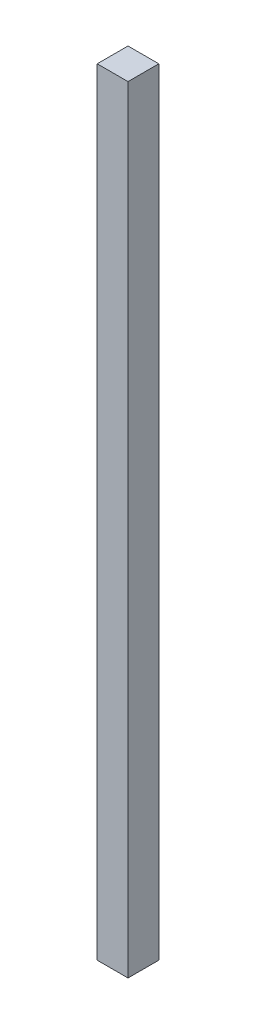
ISO-10303-21;
HEADER;
FILE_DESCRIPTION(('STEP AP214'),'2;1');
FILE_NAME('part.step','',(''),(''),'','','');
FILE_SCHEMA(('AUTOMOTIVE_DESIGN { 1 0 10303 214 1 1 1 1 }'));
ENDSEC;
DATA;
#1=APPLICATION_CONTEXT('core data for automotive mechanical design processes');
#2=APPLICATION_PROTOCOL_DEFINITION('international standard','automotive_design',2000,#1);
#3=PRODUCT_CONTEXT('',#1,'mechanical');
#4=PRODUCT('Part','Part','',(#3));
#5=PRODUCT_RELATED_PRODUCT_CATEGORY('part','',(#4));
#6=PRODUCT_DEFINITION_FORMATION('','',#4);
#7=PRODUCT_DEFINITION_CONTEXT('part definition',#1,'design');
#8=PRODUCT_DEFINITION('design','',#6,#7);
#9=PRODUCT_DEFINITION_SHAPE('','',#8);
#10=(LENGTH_UNIT() NAMED_UNIT(*) SI_UNIT(.MILLI.,.METRE.));
#11=(NAMED_UNIT(*) PLANE_ANGLE_UNIT() SI_UNIT($,.RADIAN.));
#12=(NAMED_UNIT(*) SI_UNIT($,.STERADIAN.) SOLID_ANGLE_UNIT());
#13=UNCERTAINTY_MEASURE_WITH_UNIT(LENGTH_MEASURE(1.E-05),#10,'distance_accuracy_value','');
#14=(GEOMETRIC_REPRESENTATION_CONTEXT(3) GLOBAL_UNCERTAINTY_ASSIGNED_CONTEXT((#13)) GLOBAL_UNIT_ASSIGNED_CONTEXT((#10,
#11,#12)) REPRESENTATION_CONTEXT('',''));
#15=CARTESIAN_POINT('',(0.,0.,0.));
#16=DIRECTION('',(0.,0.,1.));
#17=DIRECTION('',(1.,0.,0.));
#18=AXIS2_PLACEMENT_3D('',#15,#16,#17);
#19=CARTESIAN_POINT('',(2.5,126.,-2.5));
#20=DIRECTION('',(-1.,0.,0.));
#21=DIRECTION('',(0.,0.,1.));
#22=AXIS2_PLACEMENT_3D('',#19,#20,#21);
#23=PLANE('',#22);
#24=DIRECTION('',(0.,0.,-1.));
#25=VECTOR('',#24,1.);
#26=CARTESIAN_POINT('',(2.5,0.,-2.5));
#27=LINE('',#26,#25);
#28=CARTESIAN_POINT('',(2.5,0.,2.5));
#29=VERTEX_POINT('',#28);
#30=CARTESIAN_POINT('',(2.5,0.,-2.5));
#31=VERTEX_POINT('',#30);
#32=EDGE_CURVE('E98',#29,#31,#27,.T.);
#33=ORIENTED_EDGE('',*,*,#32,.T.);
#34=DIRECTION('',(0.,-1.,0.));
#35=VECTOR('',#34,1.);
#36=CARTESIAN_POINT('',(2.5,126.,-2.5));
#37=LINE('',#36,#35);
#38=CARTESIAN_POINT('',(2.5,126.,-2.5));
#39=VERTEX_POINT('',#38);
#40=EDGE_CURVE('E11',#39,#31,#37,.T.);
#41=ORIENTED_EDGE('',*,*,#40,.F.);
#42=DIRECTION('',(0.,0.,-1.));
#43=VECTOR('',#42,1.);
#44=CARTESIAN_POINT('',(2.5,126.,-2.5));
#45=LINE('',#44,#43);
#46=CARTESIAN_POINT('',(2.5,126.,2.5));
#47=VERTEX_POINT('',#46);
#48=EDGE_CURVE('E86',#47,#39,#45,.T.);
#49=ORIENTED_EDGE('',*,*,#48,.F.);
#50=DIRECTION('',(0.,-1.,0.));
#51=VECTOR('',#50,1.);
#52=CARTESIAN_POINT('',(2.5,126.,2.5));
#53=LINE('',#52,#51);
#54=EDGE_CURVE('E94',#47,#29,#53,.T.);
#55=ORIENTED_EDGE('',*,*,#54,.T.);
#56=EDGE_LOOP('',(#33,#41,#49,#55));
#57=FACE_BOUND('',#56,.T.);
#58=ADVANCED_FACE('F35',(#57),#23,.F.);
#59=CARTESIAN_POINT('',(-2.5,126.,-2.5));
#60=DIRECTION('',(0.,0.,1.));
#61=DIRECTION('',(1.,0.,0.));
#62=AXIS2_PLACEMENT_3D('',#59,#60,#61);
#63=PLANE('',#62);
#64=DIRECTION('',(-1.,0.,0.));
#65=VECTOR('',#64,1.);
#66=CARTESIAN_POINT('',(-2.5,0.,-2.5));
#67=LINE('',#66,#65);
#68=CARTESIAN_POINT('',(-2.5,0.,-2.5));
#69=VERTEX_POINT('',#68);
#70=EDGE_CURVE('E90',#31,#69,#67,.T.);
#71=ORIENTED_EDGE('',*,*,#70,.T.);
#72=DIRECTION('',(0.,-1.,0.));
#73=VECTOR('',#72,1.);
#74=CARTESIAN_POINT('',(-2.5,126.,-2.5));
#75=LINE('',#74,#73);
#76=CARTESIAN_POINT('',(-2.5,126.,-2.5));
#77=VERTEX_POINT('',#76);
#78=EDGE_CURVE('E43',#77,#69,#75,.T.);
#79=ORIENTED_EDGE('',*,*,#78,.F.);
#80=DIRECTION('',(-1.,0.,0.));
#81=VECTOR('',#80,1.);
#82=CARTESIAN_POINT('',(-2.5,126.,-2.5));
#83=LINE('',#82,#81);
#84=EDGE_CURVE('E81',#39,#77,#83,.T.);
#85=ORIENTED_EDGE('',*,*,#84,.F.);
#86=ORIENTED_EDGE('',*,*,#40,.T.);
#87=EDGE_LOOP('',(#71,#79,#85,#86));
#88=FACE_BOUND('',#87,.T.);
#89=ADVANCED_FACE('F89',(#88),#63,.F.);
#90=CARTESIAN_POINT('',(-2.5,126.,-2.5));
#91=DIRECTION('',(1.,0.,0.));
#92=DIRECTION('',(0.,0.,-1.));
#93=AXIS2_PLACEMENT_3D('',#90,#91,#92);
#94=PLANE('',#93);
#95=DIRECTION('',(0.,0.,1.));
#96=VECTOR('',#95,1.);
#97=CARTESIAN_POINT('',(-2.5,0.,-2.5));
#98=LINE('',#97,#96);
#99=CARTESIAN_POINT('',(-2.5,0.,2.5));
#100=VERTEX_POINT('',#99);
#101=EDGE_CURVE('E68',#69,#100,#98,.T.);
#102=ORIENTED_EDGE('',*,*,#101,.T.);
#103=DIRECTION('',(0.,-1.,0.));
#104=VECTOR('',#103,1.);
#105=CARTESIAN_POINT('',(-2.5,126.,2.5));
#106=LINE('',#105,#104);
#107=CARTESIAN_POINT('',(-2.5,126.,2.5));
#108=VERTEX_POINT('',#107);
#109=EDGE_CURVE('E91',#108,#100,#106,.T.);
#110=ORIENTED_EDGE('',*,*,#109,.F.);
#111=DIRECTION('',(0.,0.,1.));
#112=VECTOR('',#111,1.);
#113=CARTESIAN_POINT('',(-2.5,126.,-2.5));
#114=LINE('',#113,#112);
#115=EDGE_CURVE('E84',#77,#108,#114,.T.);
#116=ORIENTED_EDGE('',*,*,#115,.F.);
#117=ORIENTED_EDGE('',*,*,#78,.T.);
#118=EDGE_LOOP('',(#102,#110,#116,#117));
#119=FACE_BOUND('',#118,.T.);
#120=ADVANCED_FACE('F92',(#119),#94,.F.);
#121=CARTESIAN_POINT('',(-2.5,126.,2.5));
#122=DIRECTION('',(0.,0.,-1.));
#123=DIRECTION('',(-1.,0.,0.));
#124=AXIS2_PLACEMENT_3D('',#121,#122,#123);
#125=PLANE('',#124);
#126=DIRECTION('',(1.,0.,0.));
#127=VECTOR('',#126,1.);
#128=CARTESIAN_POINT('',(-2.5,0.,2.5));
#129=LINE('',#128,#127);
#130=EDGE_CURVE('E74',#100,#29,#129,.T.);
#131=ORIENTED_EDGE('',*,*,#130,.T.);
#132=ORIENTED_EDGE('',*,*,#54,.F.);
#133=DIRECTION('',(1.,0.,0.));
#134=VECTOR('',#133,1.);
#135=CARTESIAN_POINT('',(-2.5,126.,2.5));
#136=LINE('',#135,#134);
#137=EDGE_CURVE('E51',#108,#47,#136,.T.);
#138=ORIENTED_EDGE('',*,*,#137,.F.);
#139=ORIENTED_EDGE('',*,*,#109,.T.);
#140=EDGE_LOOP('',(#131,#132,#138,#139));
#141=FACE_BOUND('',#140,.T.);
#142=ADVANCED_FACE('F105',(#141),#125,.F.);
#143=CARTESIAN_POINT('',(0.,126.,0.));
#144=DIRECTION('',(0.,1.,0.));
#145=DIRECTION('',(0.,0.,1.));
#146=AXIS2_PLACEMENT_3D('',#143,#144,#145);
#147=PLANE('',#146);
#148=ORIENTED_EDGE('',*,*,#48,.T.);
#149=ORIENTED_EDGE('',*,*,#84,.T.);
#150=ORIENTED_EDGE('',*,*,#115,.T.);
#151=ORIENTED_EDGE('',*,*,#137,.T.);
#152=EDGE_LOOP('',(#148,#149,#150,#151));
#153=FACE_BOUND('',#152,.T.);
#154=ADVANCED_FACE('F82',(#153),#147,.T.);
#155=CARTESIAN_POINT('',(0.,0.,0.));
#156=DIRECTION('',(0.,1.,0.));
#157=DIRECTION('',(0.,0.,1.));
#158=AXIS2_PLACEMENT_3D('',#155,#156,#157);
#159=PLANE('',#158);
#160=ORIENTED_EDGE('',*,*,#32,.F.);
#161=ORIENTED_EDGE('',*,*,#130,.F.);
#162=ORIENTED_EDGE('',*,*,#101,.F.);
#163=ORIENTED_EDGE('',*,*,#70,.F.);
#164=EDGE_LOOP('',(#160,#161,#162,#163));
#165=FACE_BOUND('',#164,.T.);
#166=ADVANCED_FACE('F108',(#165),#159,.F.);
#167=CLOSED_SHELL('',(#58,#89,#120,#142,#154,#166));
#168=MANIFOLD_SOLID_BREP('B2',#167);
#169=ADVANCED_BREP_SHAPE_REPRESENTATION('',(#18,#168),#14);
#170=SHAPE_DEFINITION_REPRESENTATION(#9,#169);
ENDSEC;
END-ISO-10303-21;
